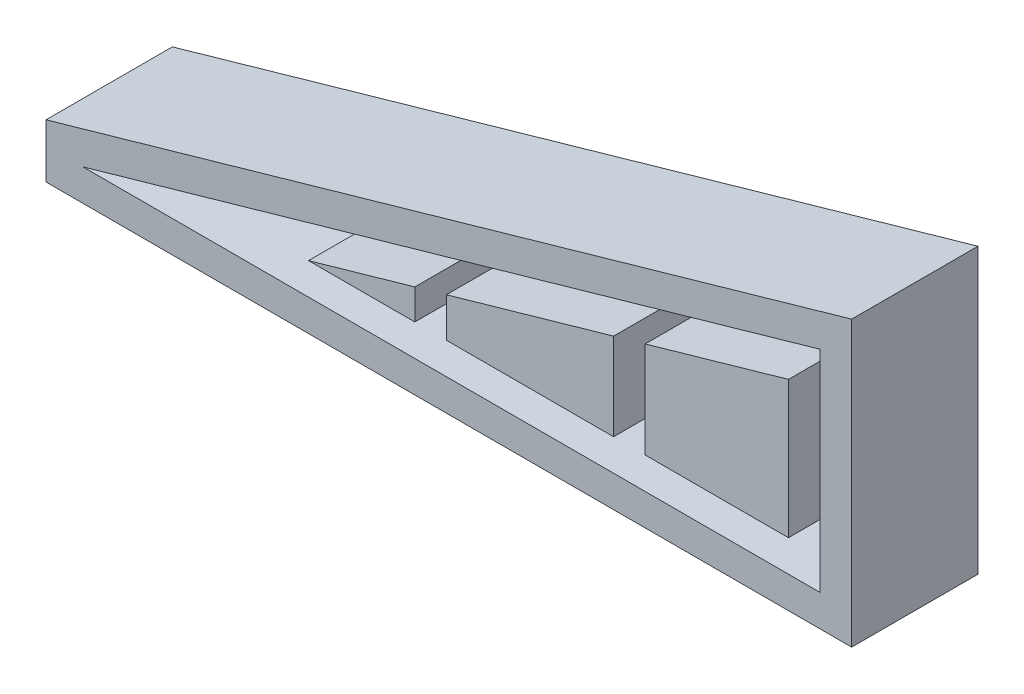
ISO-10303-21;
HEADER;
FILE_DESCRIPTION(('STEP AP214'),'2;1');
FILE_NAME('part.step','',(''),(''),'','','');
FILE_SCHEMA(('AUTOMOTIVE_DESIGN { 1 0 10303 214 1 1 1 1 }'));
ENDSEC;
DATA;
#1=APPLICATION_CONTEXT('core data for automotive mechanical design processes');
#2=APPLICATION_PROTOCOL_DEFINITION('international standard','automotive_design',2000,#1);
#3=PRODUCT_CONTEXT('',#1,'mechanical');
#4=PRODUCT('Part','Part','',(#3));
#5=PRODUCT_RELATED_PRODUCT_CATEGORY('part','',(#4));
#6=PRODUCT_DEFINITION_FORMATION('','',#4);
#7=PRODUCT_DEFINITION_CONTEXT('part definition',#1,'design');
#8=PRODUCT_DEFINITION('design','',#6,#7);
#9=PRODUCT_DEFINITION_SHAPE('','',#8);
#10=(LENGTH_UNIT() NAMED_UNIT(*) SI_UNIT(.MILLI.,.METRE.));
#11=(NAMED_UNIT(*) PLANE_ANGLE_UNIT() SI_UNIT($,.RADIAN.));
#12=(NAMED_UNIT(*) SI_UNIT($,.STERADIAN.) SOLID_ANGLE_UNIT());
#13=UNCERTAINTY_MEASURE_WITH_UNIT(LENGTH_MEASURE(1.E-05),#10,'distance_accuracy_value','');
#14=(GEOMETRIC_REPRESENTATION_CONTEXT(3) GLOBAL_UNCERTAINTY_ASSIGNED_CONTEXT((#13)) GLOBAL_UNIT_ASSIGNED_CONTEXT((#10,
#11,#12)) REPRESENTATION_CONTEXT('',''));
#15=CARTESIAN_POINT('',(0.,0.,0.));
#16=DIRECTION('',(0.,0.,1.));
#17=DIRECTION('',(1.,0.,0.));
#18=AXIS2_PLACEMENT_3D('',#15,#16,#17);
#19=CARTESIAN_POINT('',(0.,-14.414149003123,10.));
#20=DIRECTION('',(0.,-1.,0.));
#21=DIRECTION('',(1.,0.,0.));
#22=AXIS2_PLACEMENT_3D('',#19,#20,#21);
#23=PLANE('',#22);
#24=DIRECTION('',(-1.,0.,0.));
#25=VECTOR('',#24,1.);
#26=CARTESIAN_POINT('',(0.,-14.414149003123,0.));
#27=LINE('',#26,#25);
#28=CARTESIAN_POINT('',(28.4799984689915,-14.414149003123,0.));
#29=VERTEX_POINT('',#28);
#30=CARTESIAN_POINT('',(-41.5200015310085,-14.414149003123,0.));
#31=VERTEX_POINT('',#30);
#32=EDGE_CURVE('E344',#29,#31,#27,.T.);
#33=ORIENTED_EDGE('',*,*,#32,.T.);
#34=DIRECTION('',(0.,0.,-1.));
#35=VECTOR('',#34,1.);
#36=CARTESIAN_POINT('',(-41.5200015310085,-14.414149003123,10.));
#37=LINE('',#36,#35);
#38=CARTESIAN_POINT('',(-41.5200015310085,-14.414149003123,10.));
#39=VERTEX_POINT('',#38);
#40=EDGE_CURVE('E12',#39,#31,#37,.T.);
#41=ORIENTED_EDGE('',*,*,#40,.F.);
#42=DIRECTION('',(-1.,0.,0.));
#43=VECTOR('',#42,1.);
#44=CARTESIAN_POINT('',(0.,-14.414149003123,10.));
#45=LINE('',#44,#43);
#46=CARTESIAN_POINT('',(28.4799984689915,-14.414149003123,10.));
#47=VERTEX_POINT('',#46);
#48=EDGE_CURVE('E358',#47,#39,#45,.T.);
#49=ORIENTED_EDGE('',*,*,#48,.F.);
#50=DIRECTION('',(0.,0.,-1.));
#51=VECTOR('',#50,1.);
#52=CARTESIAN_POINT('',(28.4799984689915,-14.414149003123,10.));
#53=LINE('',#52,#51);
#54=EDGE_CURVE('E373',#47,#29,#53,.T.);
#55=ORIENTED_EDGE('',*,*,#54,.T.);
#56=EDGE_LOOP('',(#33,#41,#49,#55));
#57=FACE_BOUND('',#56,.T.);
#58=ADVANCED_FACE('F110',(#57),#23,.F.);
#59=CARTESIAN_POINT('',(0.673926036220537,-2.35874112677188,10.));
#60=DIRECTION('',(-0.274721127897378,0.961523947640823,0.));
#61=DIRECTION('',(-0.961523947640823,-0.274721127897378,0.));
#62=AXIS2_PLACEMENT_3D('',#59,#60,#61);
#63=PLANE('',#62);
#64=DIRECTION('',(0.961523947640823,0.274721127897378,0.));
#65=VECTOR('',#64,1.);
#66=CARTESIAN_POINT('',(0.673926036220537,-2.35874112677188,0.));
#67=LINE('',#66,#65);
#68=CARTESIAN_POINT('',(28.4799984689915,5.58585099687697,0.));
#69=VERTEX_POINT('',#68);
#70=EDGE_CURVE('E368',#31,#69,#67,.T.);
#71=ORIENTED_EDGE('',*,*,#70,.T.);
#72=DIRECTION('',(0.,0.,-1.));
#73=VECTOR('',#72,1.);
#74=CARTESIAN_POINT('',(28.4799984689915,5.58585099687697,10.));
#75=LINE('',#74,#73);
#76=CARTESIAN_POINT('',(28.4799984689915,5.58585099687697,10.));
#77=VERTEX_POINT('',#76);
#78=EDGE_CURVE('E119',#77,#69,#75,.T.);
#79=ORIENTED_EDGE('',*,*,#78,.F.);
#80=DIRECTION('',(0.961523947640823,0.274721127897378,0.));
#81=VECTOR('',#80,1.);
#82=CARTESIAN_POINT('',(0.673926036220537,-2.35874112677188,10.));
#83=LINE('',#82,#81);
#84=EDGE_CURVE('E361',#39,#77,#83,.T.);
#85=ORIENTED_EDGE('',*,*,#84,.F.);
#86=ORIENTED_EDGE('',*,*,#40,.T.);
#87=EDGE_LOOP('',(#71,#79,#85,#86));
#88=FACE_BOUND('',#87,.T.);
#89=ADVANCED_FACE('F412',(#88),#63,.F.);
#90=CARTESIAN_POINT('',(-45.0296726233531,0.,10.));
#91=DIRECTION('',(-1.,0.,0.));
#92=DIRECTION('',(0.,0.,1.));
#93=AXIS2_PLACEMENT_3D('',#90,#91,#92);
#94=PLANE('',#93);
#95=DIRECTION('',(0.,0.,-1.));
#96=VECTOR('',#95,1.);
#97=CARTESIAN_POINT('',(-45.0296726233531,-12.2968650769584,10.));
#98=LINE('',#97,#96);
#99=CARTESIAN_POINT('',(-45.0296726233531,-12.2968650769584,10.));
#100=VERTEX_POINT('',#99);
#101=CARTESIAN_POINT('',(-45.0296726233531,-12.2968650769584,-2.));
#102=VERTEX_POINT('',#101);
#103=EDGE_CURVE('E365',#100,#102,#98,.T.);
#104=ORIENTED_EDGE('',*,*,#103,.T.);
#105=DIRECTION('',(0.,1.,0.));
#106=VECTOR('',#105,1.);
#107=CARTESIAN_POINT('',(-45.0296726233531,-12.2968650769584,-2.));
#108=LINE('',#107,#106);
#109=CARTESIAN_POINT('',(-45.0296726233531,-17.414149003123,-2.));
#110=VERTEX_POINT('',#109);
#111=EDGE_CURVE('E338',#110,#102,#108,.T.);
#112=ORIENTED_EDGE('',*,*,#111,.F.);
#113=DIRECTION('',(0.,0.,-1.));
#114=VECTOR('',#113,1.);
#115=CARTESIAN_POINT('',(-45.0296726233531,-17.414149003123,10.));
#116=LINE('',#115,#114);
#117=CARTESIAN_POINT('',(-45.0296726233531,-17.414149003123,10.));
#118=VERTEX_POINT('',#117);
#119=EDGE_CURVE('E114',#118,#110,#116,.T.);
#120=ORIENTED_EDGE('',*,*,#119,.F.);
#121=DIRECTION('',(0.,1.,0.));
#122=VECTOR('',#121,1.);
#123=CARTESIAN_POINT('',(-45.0296726233531,0.,10.));
#124=LINE('',#123,#122);
#125=EDGE_CURVE('E345',#118,#100,#124,.T.);
#126=ORIENTED_EDGE('',*,*,#125,.T.);
#127=EDGE_LOOP('',(#104,#112,#120,#126));
#128=FACE_BOUND('',#127,.T.);
#129=ADVANCED_FACE('F112',(#128),#94,.T.);
#130=CARTESIAN_POINT('',(0.,-17.414149003123,10.));
#131=DIRECTION('',(0.,-1.,0.));
#132=DIRECTION('',(1.,0.,0.));
#133=AXIS2_PLACEMENT_3D('',#130,#131,#132);
#134=PLANE('',#133);
#135=ORIENTED_EDGE('',*,*,#119,.T.);
#136=DIRECTION('',(-1.,0.,0.));
#137=VECTOR('',#136,1.);
#138=CARTESIAN_POINT('',(-45.0296726233531,-17.414149003123,-2.));
#139=LINE('',#138,#137);
#140=CARTESIAN_POINT('',(31.4799984689915,-17.414149003123,-2.));
#141=VERTEX_POINT('',#140);
#142=EDGE_CURVE('E335',#141,#110,#139,.T.);
#143=ORIENTED_EDGE('',*,*,#142,.F.);
#144=DIRECTION('',(0.,0.,-1.));
#145=VECTOR('',#144,1.);
#146=CARTESIAN_POINT('',(31.4799984689915,-17.414149003123,10.));
#147=LINE('',#146,#145);
#148=CARTESIAN_POINT('',(31.4799984689915,-17.414149003123,10.));
#149=VERTEX_POINT('',#148);
#150=EDGE_CURVE('E380',#149,#141,#147,.T.);
#151=ORIENTED_EDGE('',*,*,#150,.F.);
#152=DIRECTION('',(-1.,0.,0.));
#153=VECTOR('',#152,1.);
#154=CARTESIAN_POINT('',(0.,-17.414149003123,10.));
#155=LINE('',#154,#153);
#156=EDGE_CURVE('E348',#149,#118,#155,.T.);
#157=ORIENTED_EDGE('',*,*,#156,.T.);
#158=EDGE_LOOP('',(#135,#143,#151,#157));
#159=FACE_BOUND('',#158,.T.);
#160=ADVANCED_FACE('F385',(#159),#134,.T.);
#161=CARTESIAN_POINT('',(31.4799984689915,0.,10.));
#162=DIRECTION('',(1.,0.,0.));
#163=DIRECTION('',(0.,1.,0.));
#164=AXIS2_PLACEMENT_3D('',#161,#162,#163);
#165=PLANE('',#164);
#166=ORIENTED_EDGE('',*,*,#150,.T.);
#167=DIRECTION('',(0.,-1.,0.));
#168=VECTOR('',#167,1.);
#169=CARTESIAN_POINT('',(31.4799984689915,-17.414149003123,-2.));
#170=LINE('',#169,#168);
#171=CARTESIAN_POINT('',(31.4799984689915,9.56304094942577,-2.));
#172=VERTEX_POINT('',#171);
#173=EDGE_CURVE('E332',#172,#141,#170,.T.);
#174=ORIENTED_EDGE('',*,*,#173,.F.);
#175=DIRECTION('',(0.,0.,-1.));
#176=VECTOR('',#175,1.);
#177=CARTESIAN_POINT('',(31.4799984689915,9.56304094942577,10.));
#178=LINE('',#177,#176);
#179=CARTESIAN_POINT('',(31.4799984689915,9.56304094942577,10.));
#180=VERTEX_POINT('',#179);
#181=EDGE_CURVE('E379',#180,#172,#178,.T.);
#182=ORIENTED_EDGE('',*,*,#181,.F.);
#183=DIRECTION('',(0.,-1.,0.));
#184=VECTOR('',#183,1.);
#185=CARTESIAN_POINT('',(31.4799984689915,0.,10.));
#186=LINE('',#185,#184);
#187=EDGE_CURVE('E352',#180,#149,#186,.T.);
#188=ORIENTED_EDGE('',*,*,#187,.T.);
#189=EDGE_LOOP('',(#166,#174,#182,#188));
#190=FACE_BOUND('',#189,.T.);
#191=ADVANCED_FACE('F396',(#190),#165,.T.);
#192=CARTESIAN_POINT('',(-0.150237347471598,0.525830716150594,10.));
#193=DIRECTION('',(-0.274721127897378,0.961523947640823,0.));
#194=DIRECTION('',(-0.961523947640823,-0.274721127897378,0.));
#195=AXIS2_PLACEMENT_3D('',#192,#193,#194);
#196=PLANE('',#195);
#197=ORIENTED_EDGE('',*,*,#181,.T.);
#198=DIRECTION('',(0.961523947640823,0.274721127897378,0.));
#199=VECTOR('',#198,1.);
#200=CARTESIAN_POINT('',(31.4799984689915,9.56304094942577,-2.));
#201=LINE('',#200,#199);
#202=EDGE_CURVE('E341',#102,#172,#201,.T.);
#203=ORIENTED_EDGE('',*,*,#202,.F.);
#204=ORIENTED_EDGE('',*,*,#103,.F.);
#205=DIRECTION('',(0.961523947640823,0.274721127897378,0.));
#206=VECTOR('',#205,1.);
#207=CARTESIAN_POINT('',(-0.150237347471598,0.525830716150594,10.));
#208=LINE('',#207,#206);
#209=EDGE_CURVE('E355',#100,#180,#208,.T.);
#210=ORIENTED_EDGE('',*,*,#209,.T.);
#211=EDGE_LOOP('',(#197,#203,#204,#210));
#212=FACE_BOUND('',#211,.T.);
#213=ADVANCED_FACE('F395',(#212),#196,.T.);
#214=CARTESIAN_POINT('',(28.4799984689915,0.,10.));
#215=DIRECTION('',(1.,0.,0.));
#216=DIRECTION('',(0.,1.,0.));
#217=AXIS2_PLACEMENT_3D('',#214,#215,#216);
#218=PLANE('',#217);
#219=DIRECTION('',(0.,-1.,0.));
#220=VECTOR('',#219,1.);
#221=CARTESIAN_POINT('',(28.4799984689915,0.,0.));
#222=LINE('',#221,#220);
#223=EDGE_CURVE('E349',#69,#29,#222,.T.);
#224=ORIENTED_EDGE('',*,*,#223,.T.);
#225=ORIENTED_EDGE('',*,*,#54,.F.);
#226=DIRECTION('',(0.,-1.,0.));
#227=VECTOR('',#226,1.);
#228=CARTESIAN_POINT('',(28.4799984689915,0.,10.));
#229=LINE('',#228,#227);
#230=EDGE_CURVE('E363',#77,#47,#229,.T.);
#231=ORIENTED_EDGE('',*,*,#230,.F.);
#232=ORIENTED_EDGE('',*,*,#78,.T.);
#233=EDGE_LOOP('',(#224,#225,#231,#232));
#234=FACE_BOUND('',#233,.T.);
#235=ADVANCED_FACE('F403',(#234),#218,.F.);
#236=CARTESIAN_POINT('',(0.,0.,10.));
#237=DIRECTION('',(0.,0.,1.));
#238=DIRECTION('',(1.,0.,0.));
#239=AXIS2_PLACEMENT_3D('',#236,#237,#238);
#240=PLANE('',#239);
#241=ORIENTED_EDGE('',*,*,#125,.F.);
#242=ORIENTED_EDGE('',*,*,#156,.F.);
#243=ORIENTED_EDGE('',*,*,#187,.F.);
#244=ORIENTED_EDGE('',*,*,#209,.F.);
#245=EDGE_LOOP('',(#241,#242,#243,#244));
#246=FACE_BOUND('',#245,.T.);
#247=ORIENTED_EDGE('',*,*,#48,.T.);
#248=ORIENTED_EDGE('',*,*,#84,.T.);
#249=ORIENTED_EDGE('',*,*,#230,.T.);
#250=EDGE_LOOP('',(#247,#248,#249));
#251=FACE_BOUND('',#250,.T.);
#252=ADVANCED_FACE('F399',(#246,#251),#240,.T.);
#253=CARTESIAN_POINT('',(0.,0.,0.));
#254=DIRECTION('',(0.,0.,-1.));
#255=DIRECTION('',(-1.,0.,0.));
#256=AXIS2_PLACEMENT_3D('',#253,#254,#255);
#257=PLANE('',#256);
#258=DIRECTION('',(0.,1.,0.));
#259=VECTOR('',#258,1.);
#260=CARTESIAN_POINT('',(11.8726592361488,0.,0.));
#261=LINE('',#260,#259);
#262=CARTESIAN_POINT('',(11.8726592361488,-11.414149003123,0.));
#263=VERTEX_POINT('',#262);
#264=CARTESIAN_POINT('',(11.8726592361488,-2.27915016505545,0.));
#265=VERTEX_POINT('',#264);
#266=EDGE_CURVE('E269',#263,#265,#261,.T.);
#267=ORIENTED_EDGE('',*,*,#266,.T.);
#268=DIRECTION('',(0.961523947640823,0.274721127897378,0.));
#269=VECTOR('',#268,1.);
#270=CARTESIAN_POINT('',(1.49808941991267,-5.24331296969435,0.));
#271=LINE('',#270,#269);
#272=CARTESIAN_POINT('',(25.4799984689915,1.60866104432817,0.));
#273=VERTEX_POINT('',#272);
#274=EDGE_CURVE('E243',#265,#273,#271,.T.);
#275=ORIENTED_EDGE('',*,*,#274,.T.);
#276=DIRECTION('',(0.,-1.,0.));
#277=VECTOR('',#276,1.);
#278=CARTESIAN_POINT('',(25.4799984689915,0.,0.));
#279=LINE('',#278,#277);
#280=CARTESIAN_POINT('',(25.4799984689915,-11.414149003123,0.));
#281=VERTEX_POINT('',#280);
#282=EDGE_CURVE('E259',#273,#281,#279,.T.);
#283=ORIENTED_EDGE('',*,*,#282,.T.);
#284=DIRECTION('',(-1.,0.,0.));
#285=VECTOR('',#284,1.);
#286=CARTESIAN_POINT('',(0.,-11.414149003123,0.));
#287=LINE('',#286,#285);
#288=EDGE_CURVE('E127',#281,#263,#287,.T.);
#289=ORIENTED_EDGE('',*,*,#288,.T.);
#290=EDGE_LOOP('',(#267,#275,#283,#289));
#291=FACE_BOUND('',#290,.T.);
#292=DIRECTION('',(0.,1.,0.));
#293=VECTOR('',#292,1.);
#294=CARTESIAN_POINT('',(-7.00560858876896,0.,0.));
#295=LINE('',#294,#293);
#296=CARTESIAN_POINT('',(-7.00560858876896,-11.414149003123,0.));
#297=VERTEX_POINT('',#296);
#298=CARTESIAN_POINT('',(-7.00560858876896,-7.67294097217482,0.));
#299=VERTEX_POINT('',#298);
#300=EDGE_CURVE('E294',#297,#299,#295,.T.);
#301=ORIENTED_EDGE('',*,*,#300,.T.);
#302=DIRECTION('',(0.961523947640823,0.274721127897378,0.));
#303=VECTOR('',#302,1.);
#304=CARTESIAN_POINT('',(1.49808941991267,-5.24331296969435,0.));
#305=LINE('',#304,#303);
#306=CARTESIAN_POINT('',(8.87265923614881,-3.13629302219831,0.));
#307=VERTEX_POINT('',#306);
#308=EDGE_CURVE('E248',#299,#307,#305,.T.);
#309=ORIENTED_EDGE('',*,*,#308,.T.);
#310=DIRECTION('',(0.,-1.,0.));
#311=VECTOR('',#310,1.);
#312=CARTESIAN_POINT('',(8.87265923614881,0.,0.));
#313=LINE('',#312,#311);
#314=CARTESIAN_POINT('',(8.87265923614881,-11.414149003123,0.));
#315=VERTEX_POINT('',#314);
#316=EDGE_CURVE('E282',#307,#315,#313,.T.);
#317=ORIENTED_EDGE('',*,*,#316,.T.);
#318=DIRECTION('',(-1.,0.,0.));
#319=VECTOR('',#318,1.);
#320=CARTESIAN_POINT('',(0.,-11.414149003123,0.));
#321=LINE('',#320,#319);
#322=EDGE_CURVE('E135',#315,#297,#321,.T.);
#323=ORIENTED_EDGE('',*,*,#322,.T.);
#324=EDGE_LOOP('',(#301,#309,#317,#323));
#325=FACE_BOUND('',#324,.T.);
#326=DIRECTION('',(-1.,0.,0.));
#327=VECTOR('',#326,1.);
#328=CARTESIAN_POINT('',(0.,-11.414149003123,0.));
#329=LINE('',#328,#327);
#330=CARTESIAN_POINT('',(-10.005608588769,-11.414149003123,0.));
#331=VERTEX_POINT('',#330);
#332=CARTESIAN_POINT('',(-20.0998366970877,-11.414149003123,0.));
#333=VERTEX_POINT('',#332);
#334=EDGE_CURVE('E321',#331,#333,#329,.T.);
#335=ORIENTED_EDGE('',*,*,#334,.T.);
#336=DIRECTION('',(0.961523947640823,0.274721127897379,0.));
#337=VECTOR('',#336,1.);
#338=CARTESIAN_POINT('',(1.49808941991267,-5.24331296969434,0.));
#339=LINE('',#338,#337);
#340=CARTESIAN_POINT('',(-10.005608588769,-8.53008382931768,0.));
#341=VERTEX_POINT('',#340);
#342=EDGE_CURVE('E307',#333,#341,#339,.T.);
#343=ORIENTED_EDGE('',*,*,#342,.T.);
#344=DIRECTION('',(0.,-1.,0.));
#345=VECTOR('',#344,1.);
#346=CARTESIAN_POINT('',(-10.005608588769,0.,0.));
#347=LINE('',#346,#345);
#348=EDGE_CURVE('E312',#341,#331,#347,.T.);
#349=ORIENTED_EDGE('',*,*,#348,.T.);
#350=EDGE_LOOP('',(#335,#343,#349));
#351=FACE_BOUND('',#350,.T.);
#352=ORIENTED_EDGE('',*,*,#32,.F.);
#353=ORIENTED_EDGE('',*,*,#223,.F.);
#354=ORIENTED_EDGE('',*,*,#70,.F.);
#355=EDGE_LOOP('',(#352,#353,#354));
#356=FACE_BOUND('',#355,.T.);
#357=ADVANCED_FACE('F402',(#291,#325,#351,#356),#257,.F.);
#358=CARTESIAN_POINT('',(0.,0.,-2.));
#359=DIRECTION('',(0.,0.,-1.));
#360=DIRECTION('',(-1.,0.,0.));
#361=AXIS2_PLACEMENT_3D('',#358,#359,#360);
#362=PLANE('',#361);
#363=ORIENTED_EDGE('',*,*,#173,.T.);
#364=ORIENTED_EDGE('',*,*,#142,.T.);
#365=ORIENTED_EDGE('',*,*,#111,.T.);
#366=ORIENTED_EDGE('',*,*,#202,.T.);
#367=EDGE_LOOP('',(#363,#364,#365,#366));
#368=FACE_BOUND('',#367,.T.);
#369=ADVANCED_FACE('F391',(#368),#362,.T.);
#370=CARTESIAN_POINT('',(1.49808941991267,-5.24331296969434,10.));
#371=DIRECTION('',(-0.274721127897379,0.961523947640823,0.));
#372=DIRECTION('',(-0.961523947640823,-0.274721127897379,0.));
#373=AXIS2_PLACEMENT_3D('',#370,#371,#372);
#374=PLANE('',#373);
#375=ORIENTED_EDGE('',*,*,#342,.F.);
#376=DIRECTION('',(0.,0.,-1.));
#377=VECTOR('',#376,1.);
#378=CARTESIAN_POINT('',(-20.0998366970877,-11.414149003123,10.));
#379=LINE('',#378,#377);
#380=CARTESIAN_POINT('',(-20.0998366970877,-11.414149003123,10.));
#381=VERTEX_POINT('',#380);
#382=EDGE_CURVE('E330',#381,#333,#379,.T.);
#383=ORIENTED_EDGE('',*,*,#382,.F.);
#384=DIRECTION('',(0.961523947640823,0.274721127897379,0.));
#385=VECTOR('',#384,1.);
#386=CARTESIAN_POINT('',(1.49808941991267,-5.24331296969434,10.));
#387=LINE('',#386,#385);
#388=CARTESIAN_POINT('',(-10.005608588769,-8.53008382931768,10.));
#389=VERTEX_POINT('',#388);
#390=EDGE_CURVE('E308',#381,#389,#387,.T.);
#391=ORIENTED_EDGE('',*,*,#390,.T.);
#392=DIRECTION('',(0.,0.,-1.));
#393=VECTOR('',#392,1.);
#394=CARTESIAN_POINT('',(-10.005608588769,-8.53008382931768,10.));
#395=LINE('',#394,#393);
#396=EDGE_CURVE('E318',#389,#341,#395,.T.);
#397=ORIENTED_EDGE('',*,*,#396,.T.);
#398=EDGE_LOOP('',(#375,#383,#391,#397));
#399=FACE_BOUND('',#398,.T.);
#400=ADVANCED_FACE('F421',(#399),#374,.T.);
#401=CARTESIAN_POINT('',(0.,-11.414149003123,10.));
#402=DIRECTION('',(0.,-1.,0.));
#403=DIRECTION('',(1.,0.,0.));
#404=AXIS2_PLACEMENT_3D('',#401,#402,#403);
#405=PLANE('',#404);
#406=ORIENTED_EDGE('',*,*,#334,.F.);
#407=DIRECTION('',(0.,0.,-1.));
#408=VECTOR('',#407,1.);
#409=CARTESIAN_POINT('',(-10.005608588769,-11.414149003123,10.));
#410=LINE('',#409,#408);
#411=CARTESIAN_POINT('',(-10.005608588769,-11.414149003123,10.));
#412=VERTEX_POINT('',#411);
#413=EDGE_CURVE('E327',#412,#331,#410,.T.);
#414=ORIENTED_EDGE('',*,*,#413,.F.);
#415=DIRECTION('',(-1.,0.,0.));
#416=VECTOR('',#415,1.);
#417=CARTESIAN_POINT('',(0.,-11.414149003123,10.));
#418=LINE('',#417,#416);
#419=EDGE_CURVE('E311',#412,#381,#418,.T.);
#420=ORIENTED_EDGE('',*,*,#419,.T.);
#421=ORIENTED_EDGE('',*,*,#382,.T.);
#422=EDGE_LOOP('',(#406,#414,#420,#421));
#423=FACE_BOUND('',#422,.T.);
#424=ADVANCED_FACE('F603',(#423),#405,.T.);
#425=CARTESIAN_POINT('',(-10.005608588769,0.,10.));
#426=DIRECTION('',(1.,0.,0.));
#427=DIRECTION('',(0.,0.,-1.));
#428=AXIS2_PLACEMENT_3D('',#425,#426,#427);
#429=PLANE('',#428);
#430=ORIENTED_EDGE('',*,*,#348,.F.);
#431=ORIENTED_EDGE('',*,*,#396,.F.);
#432=DIRECTION('',(0.,-1.,0.));
#433=VECTOR('',#432,1.);
#434=CARTESIAN_POINT('',(-10.005608588769,0.,10.));
#435=LINE('',#434,#433);
#436=EDGE_CURVE('E315',#389,#412,#435,.T.);
#437=ORIENTED_EDGE('',*,*,#436,.T.);
#438=ORIENTED_EDGE('',*,*,#413,.T.);
#439=EDGE_LOOP('',(#430,#431,#437,#438));
#440=FACE_BOUND('',#439,.T.);
#441=ADVANCED_FACE('F593',(#440),#429,.T.);
#442=CARTESIAN_POINT('',(0.,0.,10.));
#443=DIRECTION('',(0.,0.,1.));
#444=DIRECTION('',(1.,0.,0.));
#445=AXIS2_PLACEMENT_3D('',#442,#443,#444);
#446=PLANE('',#445);
#447=ORIENTED_EDGE('',*,*,#390,.F.);
#448=ORIENTED_EDGE('',*,*,#419,.F.);
#449=ORIENTED_EDGE('',*,*,#436,.F.);
#450=EDGE_LOOP('',(#447,#448,#449));
#451=FACE_BOUND('',#450,.T.);
#452=ADVANCED_FACE('F583',(#451),#446,.T.);
#453=CARTESIAN_POINT('',(1.49808941991267,-5.24331296969435,10.));
#454=DIRECTION('',(-0.274721127897378,0.961523947640823,0.));
#455=DIRECTION('',(-0.961523947640823,-0.274721127897378,0.));
#456=AXIS2_PLACEMENT_3D('',#453,#454,#455);
#457=PLANE('',#456);
#458=ORIENTED_EDGE('',*,*,#308,.F.);
#459=DIRECTION('',(0.,0.,-1.));
#460=VECTOR('',#459,1.);
#461=CARTESIAN_POINT('',(-7.00560858876896,-7.67294097217482,10.));
#462=LINE('',#461,#460);
#463=CARTESIAN_POINT('',(-7.00560858876896,-7.67294097217482,10.));
#464=VERTEX_POINT('',#463);
#465=EDGE_CURVE('E305',#464,#299,#462,.T.);
#466=ORIENTED_EDGE('',*,*,#465,.F.);
#467=DIRECTION('',(0.961523947640823,0.274721127897378,0.));
#468=VECTOR('',#467,1.);
#469=CARTESIAN_POINT('',(1.49808941991267,-5.24331296969435,10.));
#470=LINE('',#469,#468);
#471=CARTESIAN_POINT('',(8.87265923614881,-3.13629302219831,10.));
#472=VERTEX_POINT('',#471);
#473=EDGE_CURVE('E278',#464,#472,#470,.T.);
#474=ORIENTED_EDGE('',*,*,#473,.T.);
#475=DIRECTION('',(0.,0.,-1.));
#476=VECTOR('',#475,1.);
#477=CARTESIAN_POINT('',(8.87265923614881,-3.13629302219831,10.));
#478=LINE('',#477,#476);
#479=EDGE_CURVE('E291',#472,#307,#478,.T.);
#480=ORIENTED_EDGE('',*,*,#479,.T.);
#481=EDGE_LOOP('',(#458,#466,#474,#480));
#482=FACE_BOUND('',#481,.T.);
#483=ADVANCED_FACE('F573',(#482),#457,.T.);
#484=CARTESIAN_POINT('',(-7.00560858876896,0.,10.));
#485=DIRECTION('',(-1.,0.,0.));
#486=DIRECTION('',(0.,0.,1.));
#487=AXIS2_PLACEMENT_3D('',#484,#485,#486);
#488=PLANE('',#487);
#489=ORIENTED_EDGE('',*,*,#300,.F.);
#490=DIRECTION('',(0.,0.,-1.));
#491=VECTOR('',#490,1.);
#492=CARTESIAN_POINT('',(-7.00560858876896,-11.414149003123,10.));
#493=LINE('',#492,#491);
#494=CARTESIAN_POINT('',(-7.00560858876896,-11.414149003123,10.));
#495=VERTEX_POINT('',#494);
#496=EDGE_CURVE('E303',#495,#297,#493,.T.);
#497=ORIENTED_EDGE('',*,*,#496,.F.);
#498=DIRECTION('',(0.,1.,0.));
#499=VECTOR('',#498,1.);
#500=CARTESIAN_POINT('',(-7.00560858876896,0.,10.));
#501=LINE('',#500,#499);
#502=EDGE_CURVE('E281',#495,#464,#501,.T.);
#503=ORIENTED_EDGE('',*,*,#502,.T.);
#504=ORIENTED_EDGE('',*,*,#465,.T.);
#505=EDGE_LOOP('',(#489,#497,#503,#504));
#506=FACE_BOUND('',#505,.T.);
#507=ADVANCED_FACE('F564',(#506),#488,.T.);
#508=CARTESIAN_POINT('',(0.,-11.414149003123,10.));
#509=DIRECTION('',(0.,-1.,0.));
#510=DIRECTION('',(1.,0.,0.));
#511=AXIS2_PLACEMENT_3D('',#508,#509,#510);
#512=PLANE('',#511);
#513=ORIENTED_EDGE('',*,*,#322,.F.);
#514=DIRECTION('',(0.,0.,-1.));
#515=VECTOR('',#514,1.);
#516=CARTESIAN_POINT('',(8.87265923614881,-11.414149003123,10.));
#517=LINE('',#516,#515);
#518=CARTESIAN_POINT('',(8.87265923614881,-11.414149003123,10.));
#519=VERTEX_POINT('',#518);
#520=EDGE_CURVE('E301',#519,#315,#517,.T.);
#521=ORIENTED_EDGE('',*,*,#520,.F.);
#522=DIRECTION('',(-1.,0.,0.));
#523=VECTOR('',#522,1.);
#524=CARTESIAN_POINT('',(0.,-11.414149003123,10.));
#525=LINE('',#524,#523);
#526=EDGE_CURVE('E285',#519,#495,#525,.T.);
#527=ORIENTED_EDGE('',*,*,#526,.T.);
#528=ORIENTED_EDGE('',*,*,#496,.T.);
#529=EDGE_LOOP('',(#513,#521,#527,#528));
#530=FACE_BOUND('',#529,.T.);
#531=ADVANCED_FACE('F554',(#530),#512,.T.);
#532=CARTESIAN_POINT('',(8.87265923614881,0.,10.));
#533=DIRECTION('',(1.,0.,0.));
#534=DIRECTION('',(0.,1.,0.));
#535=AXIS2_PLACEMENT_3D('',#532,#533,#534);
#536=PLANE('',#535);
#537=ORIENTED_EDGE('',*,*,#316,.F.);
#538=ORIENTED_EDGE('',*,*,#479,.F.);
#539=DIRECTION('',(0.,-1.,0.));
#540=VECTOR('',#539,1.);
#541=CARTESIAN_POINT('',(8.87265923614881,0.,10.));
#542=LINE('',#541,#540);
#543=EDGE_CURVE('E288',#472,#519,#542,.T.);
#544=ORIENTED_EDGE('',*,*,#543,.T.);
#545=ORIENTED_EDGE('',*,*,#520,.T.);
#546=EDGE_LOOP('',(#537,#538,#544,#545));
#547=FACE_BOUND('',#546,.T.);
#548=ADVANCED_FACE('F544',(#547),#536,.T.);
#549=CARTESIAN_POINT('',(0.,0.,10.));
#550=DIRECTION('',(0.,0.,1.));
#551=DIRECTION('',(1.,0.,0.));
#552=AXIS2_PLACEMENT_3D('',#549,#550,#551);
#553=PLANE('',#552);
#554=ORIENTED_EDGE('',*,*,#473,.F.);
#555=ORIENTED_EDGE('',*,*,#502,.F.);
#556=ORIENTED_EDGE('',*,*,#526,.F.);
#557=ORIENTED_EDGE('',*,*,#543,.F.);
#558=EDGE_LOOP('',(#554,#555,#556,#557));
#559=FACE_BOUND('',#558,.T.);
#560=ADVANCED_FACE('F535',(#559),#553,.T.);
#561=CARTESIAN_POINT('',(1.49808941991267,-5.24331296969435,10.));
#562=DIRECTION('',(-0.274721127897378,0.961523947640823,0.));
#563=DIRECTION('',(-0.961523947640823,-0.274721127897378,0.));
#564=AXIS2_PLACEMENT_3D('',#561,#562,#563);
#565=PLANE('',#564);
#566=ORIENTED_EDGE('',*,*,#274,.F.);
#567=DIRECTION('',(0.,0.,-1.));
#568=VECTOR('',#567,1.);
#569=CARTESIAN_POINT('',(11.8726592361488,-2.27915016505545,10.));
#570=LINE('',#569,#568);
#571=CARTESIAN_POINT('',(11.8726592361488,-2.27915016505545,10.));
#572=VERTEX_POINT('',#571);
#573=EDGE_CURVE('E237',#572,#265,#570,.T.);
#574=ORIENTED_EDGE('',*,*,#573,.F.);
#575=DIRECTION('',(0.961523947640823,0.274721127897378,0.));
#576=VECTOR('',#575,1.);
#577=CARTESIAN_POINT('',(1.49808941991267,-5.24331296969435,10.));
#578=LINE('',#577,#576);
#579=CARTESIAN_POINT('',(25.4799984689915,1.60866104432817,10.));
#580=VERTEX_POINT('',#579);
#581=EDGE_CURVE('E240',#572,#580,#578,.T.);
#582=ORIENTED_EDGE('',*,*,#581,.T.);
#583=DIRECTION('',(0.,0.,-1.));
#584=VECTOR('',#583,1.);
#585=CARTESIAN_POINT('',(25.4799984689915,1.60866104432817,10.));
#586=LINE('',#585,#584);
#587=EDGE_CURVE('E267',#580,#273,#586,.T.);
#588=ORIENTED_EDGE('',*,*,#587,.T.);
#589=EDGE_LOOP('',(#566,#574,#582,#588));
#590=FACE_BOUND('',#589,.T.);
#591=ADVANCED_FACE('F239',(#590),#565,.T.);
#592=CARTESIAN_POINT('',(11.8726592361488,0.,10.));
#593=DIRECTION('',(-1.,0.,0.));
#594=DIRECTION('',(0.,-1.,0.));
#595=AXIS2_PLACEMENT_3D('',#592,#593,#594);
#596=PLANE('',#595);
#597=ORIENTED_EDGE('',*,*,#266,.F.);
#598=DIRECTION('',(0.,0.,-1.));
#599=VECTOR('',#598,1.);
#600=CARTESIAN_POINT('',(11.8726592361488,-11.414149003123,10.));
#601=LINE('',#600,#599);
#602=CARTESIAN_POINT('',(11.8726592361488,-11.414149003123,10.));
#603=VERTEX_POINT('',#602);
#604=EDGE_CURVE('E249',#603,#263,#601,.T.);
#605=ORIENTED_EDGE('',*,*,#604,.F.);
#606=DIRECTION('',(0.,1.,0.));
#607=VECTOR('',#606,1.);
#608=CARTESIAN_POINT('',(11.8726592361488,0.,10.));
#609=LINE('',#608,#607);
#610=EDGE_CURVE('E255',#603,#572,#609,.T.);
#611=ORIENTED_EDGE('',*,*,#610,.T.);
#612=ORIENTED_EDGE('',*,*,#573,.T.);
#613=EDGE_LOOP('',(#597,#605,#611,#612));
#614=FACE_BOUND('',#613,.T.);
#615=ADVANCED_FACE('F261',(#614),#596,.T.);
#616=CARTESIAN_POINT('',(0.,-11.414149003123,10.));
#617=DIRECTION('',(0.,-1.,0.));
#618=DIRECTION('',(1.,0.,0.));
#619=AXIS2_PLACEMENT_3D('',#616,#617,#618);
#620=PLANE('',#619);
#621=ORIENTED_EDGE('',*,*,#288,.F.);
#622=DIRECTION('',(0.,0.,-1.));
#623=VECTOR('',#622,1.);
#624=CARTESIAN_POINT('',(25.4799984689915,-11.414149003123,10.));
#625=LINE('',#624,#623);
#626=CARTESIAN_POINT('',(25.4799984689915,-11.414149003123,10.));
#627=VERTEX_POINT('',#626);
#628=EDGE_CURVE('E275',#627,#281,#625,.T.);
#629=ORIENTED_EDGE('',*,*,#628,.F.);
#630=DIRECTION('',(-1.,0.,0.));
#631=VECTOR('',#630,1.);
#632=CARTESIAN_POINT('',(0.,-11.414149003123,10.));
#633=LINE('',#632,#631);
#634=EDGE_CURVE('E262',#627,#603,#633,.T.);
#635=ORIENTED_EDGE('',*,*,#634,.T.);
#636=ORIENTED_EDGE('',*,*,#604,.T.);
#637=EDGE_LOOP('',(#621,#629,#635,#636));
#638=FACE_BOUND('',#637,.T.);
#639=ADVANCED_FACE('F509',(#638),#620,.T.);
#640=CARTESIAN_POINT('',(25.4799984689915,0.,10.));
#641=DIRECTION('',(1.,0.,0.));
#642=DIRECTION('',(0.,1.,0.));
#643=AXIS2_PLACEMENT_3D('',#640,#641,#642);
#644=PLANE('',#643);
#645=ORIENTED_EDGE('',*,*,#282,.F.);
#646=ORIENTED_EDGE('',*,*,#587,.F.);
#647=DIRECTION('',(0.,-1.,0.));
#648=VECTOR('',#647,1.);
#649=CARTESIAN_POINT('',(25.4799984689915,0.,10.));
#650=LINE('',#649,#648);
#651=EDGE_CURVE('E258',#580,#627,#650,.T.);
#652=ORIENTED_EDGE('',*,*,#651,.T.);
#653=ORIENTED_EDGE('',*,*,#628,.T.);
#654=EDGE_LOOP('',(#645,#646,#652,#653));
#655=FACE_BOUND('',#654,.T.);
#656=ADVANCED_FACE('F499',(#655),#644,.T.);
#657=CARTESIAN_POINT('',(0.,0.,10.));
#658=DIRECTION('',(0.,0.,1.));
#659=DIRECTION('',(1.,0.,0.));
#660=AXIS2_PLACEMENT_3D('',#657,#658,#659);
#661=PLANE('',#660);
#662=ORIENTED_EDGE('',*,*,#581,.F.);
#663=ORIENTED_EDGE('',*,*,#610,.F.);
#664=ORIENTED_EDGE('',*,*,#634,.F.);
#665=ORIENTED_EDGE('',*,*,#651,.F.);
#666=EDGE_LOOP('',(#662,#663,#664,#665));
#667=FACE_BOUND('',#666,.T.);
#668=ADVANCED_FACE('F253',(#667),#661,.T.);
#669=CLOSED_SHELL('',(#58,#89,#129,#160,#191,#213,#235,#252,#357,#369,#400,#424,#441,#452,#483,
#507,#531,#548,#560,#591,#615,#639,#656,#668));
#670=MANIFOLD_SOLID_BREP('B2',#669);
#671=ADVANCED_BREP_SHAPE_REPRESENTATION('',(#18,#670),#14);
#672=SHAPE_DEFINITION_REPRESENTATION(#9,#671);
ENDSEC;
END-ISO-10303-21;
